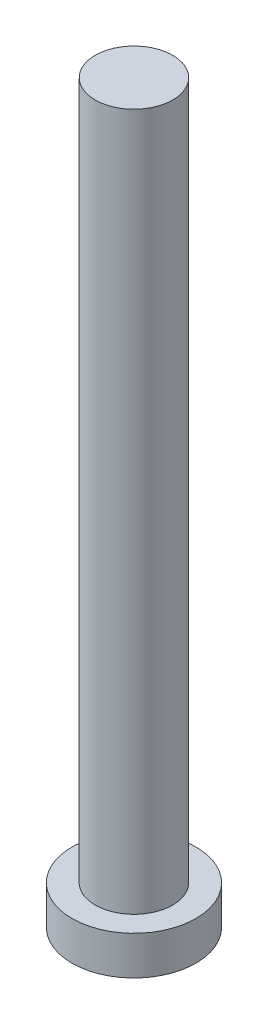
ISO-10303-21;
HEADER;
FILE_DESCRIPTION(('STEP AP214'),'2;1');
FILE_NAME('part.step','',(''),(''),'','','');
FILE_SCHEMA(('AUTOMOTIVE_DESIGN { 1 0 10303 214 1 1 1 1 }'));
ENDSEC;
DATA;
#1=APPLICATION_CONTEXT('core data for automotive mechanical design processes');
#2=APPLICATION_PROTOCOL_DEFINITION('international standard','automotive_design',2000,#1);
#3=PRODUCT_CONTEXT('',#1,'mechanical');
#4=PRODUCT('Part','Part','',(#3));
#5=PRODUCT_RELATED_PRODUCT_CATEGORY('part','',(#4));
#6=PRODUCT_DEFINITION_FORMATION('','',#4);
#7=PRODUCT_DEFINITION_CONTEXT('part definition',#1,'design');
#8=PRODUCT_DEFINITION('design','',#6,#7);
#9=PRODUCT_DEFINITION_SHAPE('','',#8);
#10=(LENGTH_UNIT() NAMED_UNIT(*) SI_UNIT(.MILLI.,.METRE.));
#11=(NAMED_UNIT(*) PLANE_ANGLE_UNIT() SI_UNIT($,.RADIAN.));
#12=(NAMED_UNIT(*) SI_UNIT($,.STERADIAN.) SOLID_ANGLE_UNIT());
#13=UNCERTAINTY_MEASURE_WITH_UNIT(LENGTH_MEASURE(1.E-05),#10,'distance_accuracy_value','');
#14=(GEOMETRIC_REPRESENTATION_CONTEXT(3) GLOBAL_UNCERTAINTY_ASSIGNED_CONTEXT((#13)) GLOBAL_UNIT_ASSIGNED_CONTEXT((#10,
#11,#12)) REPRESENTATION_CONTEXT('',''));
#15=CARTESIAN_POINT('',(0.,0.,0.));
#16=DIRECTION('',(0.,0.,1.));
#17=DIRECTION('',(1.,0.,0.));
#18=AXIS2_PLACEMENT_3D('',#15,#16,#17);
#19=CARTESIAN_POINT('',(0.,0.,0.));
#20=DIRECTION('',(0.,1.,0.));
#21=DIRECTION('',(0.,0.,1.));
#22=AXIS2_PLACEMENT_3D('',#19,#20,#21);
#23=PLANE('',#22);
#24=CARTESIAN_POINT('',(0.,0.,0.));
#25=DIRECTION('',(0.,1.,0.));
#26=DIRECTION('',(0.,0.,1.));
#27=AXIS2_PLACEMENT_3D('',#24,#25,#26);
#28=CIRCLE('',#27,5.08);
#29=CARTESIAN_POINT('',(0.,0.,5.08));
#30=VERTEX_POINT('',#29);
#31=EDGE_CURVE('E18',#30,#30,#28,.T.);
#32=ORIENTED_EDGE('',*,*,#31,.F.);
#33=EDGE_LOOP('',(#32));
#34=FACE_BOUND('',#33,.T.);
#35=ADVANCED_FACE('F15',(#34),#23,.F.);
#36=CARTESIAN_POINT('',(0.,0.,0.));
#37=DIRECTION('',(0.,1.,0.));
#38=DIRECTION('',(0.,0.,1.));
#39=AXIS2_PLACEMENT_3D('',#36,#37,#38);
#40=CYLINDRICAL_SURFACE('',#39,5.08);
#41=CARTESIAN_POINT('',(0.,3.175,0.));
#42=DIRECTION('',(0.,1.,0.));
#43=DIRECTION('',(0.,0.,1.));
#44=AXIS2_PLACEMENT_3D('',#41,#42,#43);
#45=CIRCLE('',#44,5.08);
#46=CARTESIAN_POINT('',(0.,3.175,5.08));
#47=VERTEX_POINT('',#46);
#48=EDGE_CURVE('E27',#47,#47,#45,.T.);
#49=ORIENTED_EDGE('',*,*,#48,.F.);
#50=EDGE_LOOP('',(#49));
#51=FACE_BOUND('',#50,.T.);
#52=ORIENTED_EDGE('',*,*,#31,.T.);
#53=EDGE_LOOP('',(#52));
#54=FACE_BOUND('',#53,.T.);
#55=ADVANCED_FACE('F35',(#51,#54),#40,.T.);
#56=CARTESIAN_POINT('',(0.,60.325,0.));
#57=DIRECTION('',(0.,1.,0.));
#58=DIRECTION('',(0.,0.,1.));
#59=AXIS2_PLACEMENT_3D('',#56,#57,#58);
#60=PLANE('',#59);
#61=CARTESIAN_POINT('',(0.,60.325,0.));
#62=DIRECTION('',(0.,1.,0.));
#63=DIRECTION('',(0.,0.,1.));
#64=AXIS2_PLACEMENT_3D('',#61,#62,#63);
#65=CIRCLE('',#64,3.175);
#66=CARTESIAN_POINT('',(0.,60.325,3.175));
#67=VERTEX_POINT('',#66);
#68=EDGE_CURVE('E22',#67,#67,#65,.F.);
#69=ORIENTED_EDGE('',*,*,#68,.F.);
#70=EDGE_LOOP('',(#69));
#71=FACE_BOUND('',#70,.T.);
#72=ADVANCED_FACE('F42',(#71),#60,.T.);
#73=CARTESIAN_POINT('',(0.,3.175,0.));
#74=DIRECTION('',(0.,1.,0.));
#75=DIRECTION('',(0.,0.,1.));
#76=AXIS2_PLACEMENT_3D('',#73,#74,#75);
#77=PLANE('',#76);
#78=CARTESIAN_POINT('',(0.,3.175,0.));
#79=DIRECTION('',(0.,1.,0.));
#80=DIRECTION('',(0.,0.,1.));
#81=AXIS2_PLACEMENT_3D('',#78,#79,#80);
#82=CIRCLE('',#81,3.175);
#83=CARTESIAN_POINT('',(0.,3.175,3.175));
#84=VERTEX_POINT('',#83);
#85=EDGE_CURVE('E10',#84,#84,#82,.T.);
#86=ORIENTED_EDGE('',*,*,#85,.F.);
#87=EDGE_LOOP('',(#86));
#88=FACE_BOUND('',#87,.T.);
#89=ORIENTED_EDGE('',*,*,#48,.T.);
#90=EDGE_LOOP('',(#89));
#91=FACE_BOUND('',#90,.T.);
#92=ADVANCED_FACE('F46',(#88,#91),#77,.T.);
#93=CARTESIAN_POINT('',(0.,3.175,0.));
#94=DIRECTION('',(0.,1.,0.));
#95=DIRECTION('',(0.,0.,1.));
#96=AXIS2_PLACEMENT_3D('',#93,#94,#95);
#97=CYLINDRICAL_SURFACE('',#96,3.175);
#98=ORIENTED_EDGE('',*,*,#68,.T.);
#99=EDGE_LOOP('',(#98));
#100=FACE_BOUND('',#99,.T.);
#101=ORIENTED_EDGE('',*,*,#85,.T.);
#102=EDGE_LOOP('',(#101));
#103=FACE_BOUND('',#102,.T.);
#104=ADVANCED_FACE('F44',(#100,#103),#97,.T.);
#105=CLOSED_SHELL('',(#35,#55,#72,#92,#104));
#106=MANIFOLD_SOLID_BREP('B1',#105);
#107=ADVANCED_BREP_SHAPE_REPRESENTATION('',(#18,#106),#14);
#108=SHAPE_DEFINITION_REPRESENTATION(#9,#107);
ENDSEC;
END-ISO-10303-21;
